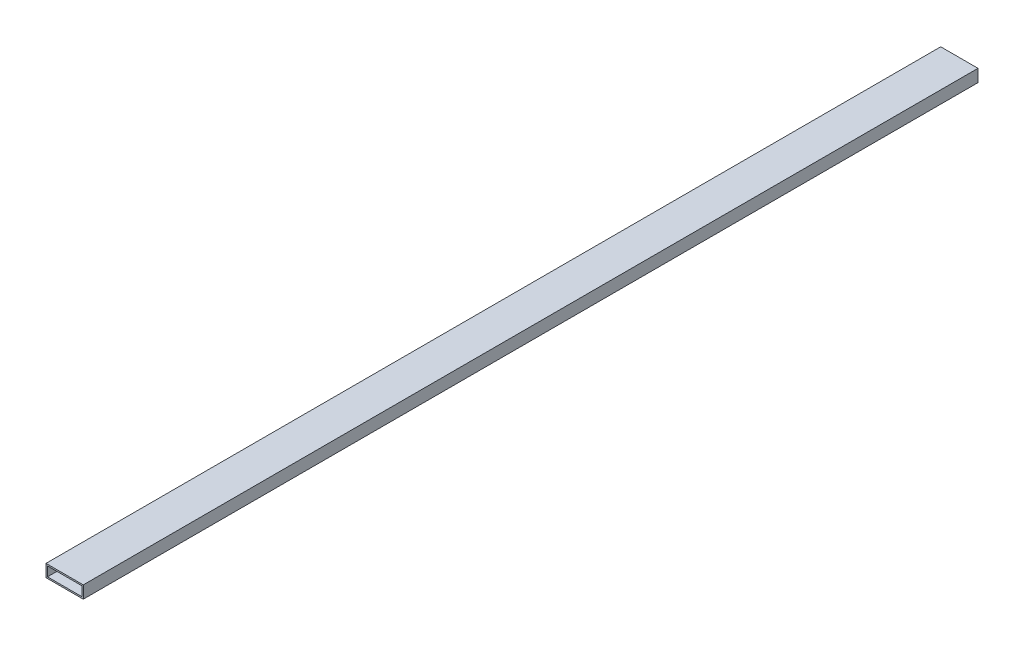
ISO-10303-21;
HEADER;
FILE_DESCRIPTION(('STEP AP214'),'2;1');
FILE_NAME('part.step','',(''),(''),'','','');
FILE_SCHEMA(('AUTOMOTIVE_DESIGN { 1 0 10303 214 1 1 1 1 }'));
ENDSEC;
DATA;
#1=APPLICATION_CONTEXT('core data for automotive mechanical design processes');
#2=APPLICATION_PROTOCOL_DEFINITION('international standard','automotive_design',2000,#1);
#3=PRODUCT_CONTEXT('',#1,'mechanical');
#4=PRODUCT('Part','Part','',(#3));
#5=PRODUCT_RELATED_PRODUCT_CATEGORY('part','',(#4));
#6=PRODUCT_DEFINITION_FORMATION('','',#4);
#7=PRODUCT_DEFINITION_CONTEXT('part definition',#1,'design');
#8=PRODUCT_DEFINITION('design','',#6,#7);
#9=PRODUCT_DEFINITION_SHAPE('','',#8);
#10=(LENGTH_UNIT() NAMED_UNIT(*) SI_UNIT(.MILLI.,.METRE.));
#11=(NAMED_UNIT(*) PLANE_ANGLE_UNIT() SI_UNIT($,.RADIAN.));
#12=(NAMED_UNIT(*) SI_UNIT($,.STERADIAN.) SOLID_ANGLE_UNIT());
#13=UNCERTAINTY_MEASURE_WITH_UNIT(LENGTH_MEASURE(1.E-05),#10,'distance_accuracy_value','');
#14=(GEOMETRIC_REPRESENTATION_CONTEXT(3) GLOBAL_UNCERTAINTY_ASSIGNED_CONTEXT((#13)) GLOBAL_UNIT_ASSIGNED_CONTEXT((#10,
#11,#12)) REPRESENTATION_CONTEXT('',''));
#15=CARTESIAN_POINT('',(0.,0.,0.));
#16=DIRECTION('',(0.,0.,1.));
#17=DIRECTION('',(1.,0.,0.));
#18=AXIS2_PLACEMENT_3D('',#15,#16,#17);
#19=CARTESIAN_POINT('',(-38.1,-12.7,-914.4));
#20=DIRECTION('',(0.,-1.,0.));
#21=DIRECTION('',(0.,0.,-1.));
#22=AXIS2_PLACEMENT_3D('',#19,#20,#21);
#23=PLANE('',#22);
#24=DIRECTION('',(0.,0.,1.));
#25=VECTOR('',#24,1.);
#26=CARTESIAN_POINT('',(-38.1,-12.7,-914.4));
#27=LINE('',#26,#25);
#28=CARTESIAN_POINT('',(-38.1,-12.7,-914.4));
#29=VERTEX_POINT('',#28);
#30=CARTESIAN_POINT('',(-38.1,-12.7,914.4));
#31=VERTEX_POINT('',#30);
#32=EDGE_CURVE('E114',#29,#31,#27,.T.);
#33=ORIENTED_EDGE('',*,*,#32,.F.);
#34=DIRECTION('',(1.,0.,0.));
#35=VECTOR('',#34,1.);
#36=CARTESIAN_POINT('',(0.,-12.7,-914.4));
#37=LINE('',#36,#35);
#38=CARTESIAN_POINT('',(38.1,-12.7,-914.4));
#39=VERTEX_POINT('',#38);
#40=EDGE_CURVE('E136',#29,#39,#37,.T.);
#41=ORIENTED_EDGE('',*,*,#40,.T.);
#42=DIRECTION('',(0.,0.,-1.));
#43=VECTOR('',#42,1.);
#44=CARTESIAN_POINT('',(38.1,-12.7,-914.4));
#45=LINE('',#44,#43);
#46=CARTESIAN_POINT('',(38.1,-12.7,914.4));
#47=VERTEX_POINT('',#46);
#48=EDGE_CURVE('E131',#47,#39,#45,.T.);
#49=ORIENTED_EDGE('',*,*,#48,.F.);
#50=DIRECTION('',(1.,0.,0.));
#51=VECTOR('',#50,1.);
#52=CARTESIAN_POINT('',(0.,-12.7,914.4));
#53=LINE('',#52,#51);
#54=EDGE_CURVE('E109',#31,#47,#53,.T.);
#55=ORIENTED_EDGE('',*,*,#54,.F.);
#56=EDGE_LOOP('',(#33,#41,#49,#55));
#57=FACE_BOUND('',#56,.T.);
#58=ADVANCED_FACE('F17',(#57),#23,.T.);
#59=CARTESIAN_POINT('',(-35.052,9.652,-914.4));
#60=DIRECTION('',(0.,-1.,0.));
#61=DIRECTION('',(0.,0.,-1.));
#62=AXIS2_PLACEMENT_3D('',#59,#60,#61);
#63=PLANE('',#62);
#64=DIRECTION('',(0.,0.,-1.));
#65=VECTOR('',#64,1.);
#66=CARTESIAN_POINT('',(-35.052,9.652,-914.4));
#67=LINE('',#66,#65);
#68=CARTESIAN_POINT('',(-35.052,9.652,-914.4));
#69=VERTEX_POINT('',#68);
#70=CARTESIAN_POINT('',(-35.052,9.652,914.4));
#71=VERTEX_POINT('',#70);
#72=EDGE_CURVE('E91',#69,#71,#67,.F.);
#73=ORIENTED_EDGE('',*,*,#72,.F.);
#74=DIRECTION('',(1.,0.,0.));
#75=VECTOR('',#74,1.);
#76=CARTESIAN_POINT('',(0.,9.652,-914.4));
#77=LINE('',#76,#75);
#78=CARTESIAN_POINT('',(35.052,9.652,-914.4));
#79=VERTEX_POINT('',#78);
#80=EDGE_CURVE('E139',#69,#79,#77,.T.);
#81=ORIENTED_EDGE('',*,*,#80,.T.);
#82=DIRECTION('',(0.,0.,1.));
#83=VECTOR('',#82,1.);
#84=CARTESIAN_POINT('',(35.052,9.652,-914.4));
#85=LINE('',#84,#83);
#86=CARTESIAN_POINT('',(35.052,9.652,914.4));
#87=VERTEX_POINT('',#86);
#88=EDGE_CURVE('E20',#87,#79,#85,.F.);
#89=ORIENTED_EDGE('',*,*,#88,.F.);
#90=DIRECTION('',(1.,0.,0.));
#91=VECTOR('',#90,1.);
#92=CARTESIAN_POINT('',(0.,9.652,914.4));
#93=LINE('',#92,#91);
#94=EDGE_CURVE('E105',#71,#87,#93,.T.);
#95=ORIENTED_EDGE('',*,*,#94,.F.);
#96=EDGE_LOOP('',(#73,#81,#89,#95));
#97=FACE_BOUND('',#96,.T.);
#98=ADVANCED_FACE('F125',(#97),#63,.T.);
#99=CARTESIAN_POINT('',(35.052,9.652,-914.4));
#100=DIRECTION('',(-1.,0.,0.));
#101=DIRECTION('',(0.,0.,1.));
#102=AXIS2_PLACEMENT_3D('',#99,#100,#101);
#103=PLANE('',#102);
#104=ORIENTED_EDGE('',*,*,#88,.T.);
#105=DIRECTION('',(0.,1.,0.));
#106=VECTOR('',#105,1.);
#107=CARTESIAN_POINT('',(35.052,0.,-914.4));
#108=LINE('',#107,#106);
#109=CARTESIAN_POINT('',(35.052,-9.652,-914.4));
#110=VERTEX_POINT('',#109);
#111=EDGE_CURVE('E88',#79,#110,#108,.F.);
#112=ORIENTED_EDGE('',*,*,#111,.T.);
#113=DIRECTION('',(0.,0.,1.));
#114=VECTOR('',#113,1.);
#115=CARTESIAN_POINT('',(35.052,-9.652,-914.4));
#116=LINE('',#115,#114);
#117=CARTESIAN_POINT('',(35.052,-9.652,914.4));
#118=VERTEX_POINT('',#117);
#119=EDGE_CURVE('E80',#118,#110,#116,.F.);
#120=ORIENTED_EDGE('',*,*,#119,.F.);
#121=DIRECTION('',(0.,1.,0.));
#122=VECTOR('',#121,1.);
#123=CARTESIAN_POINT('',(35.052,0.,914.4));
#124=LINE('',#123,#122);
#125=EDGE_CURVE('E85',#87,#118,#124,.F.);
#126=ORIENTED_EDGE('',*,*,#125,.F.);
#127=EDGE_LOOP('',(#104,#112,#120,#126));
#128=FACE_BOUND('',#127,.T.);
#129=ADVANCED_FACE('F83',(#128),#103,.T.);
#130=CARTESIAN_POINT('',(35.052,-9.652,-914.4));
#131=DIRECTION('',(0.,1.,0.));
#132=DIRECTION('',(0.,0.,1.));
#133=AXIS2_PLACEMENT_3D('',#130,#131,#132);
#134=PLANE('',#133);
#135=ORIENTED_EDGE('',*,*,#119,.T.);
#136=DIRECTION('',(1.,0.,0.));
#137=VECTOR('',#136,1.);
#138=CARTESIAN_POINT('',(0.,-9.652,-914.4));
#139=LINE('',#138,#137);
#140=CARTESIAN_POINT('',(-35.052,-9.652,-914.4));
#141=VERTEX_POINT('',#140);
#142=EDGE_CURVE('E142',#110,#141,#139,.F.);
#143=ORIENTED_EDGE('',*,*,#142,.T.);
#144=DIRECTION('',(0.,0.,-1.));
#145=VECTOR('',#144,1.);
#146=CARTESIAN_POINT('',(-35.052,-9.652,-914.4));
#147=LINE('',#146,#145);
#148=CARTESIAN_POINT('',(-35.052,-9.652,914.4));
#149=VERTEX_POINT('',#148);
#150=EDGE_CURVE('E96',#149,#141,#147,.T.);
#151=ORIENTED_EDGE('',*,*,#150,.F.);
#152=DIRECTION('',(1.,0.,0.));
#153=VECTOR('',#152,1.);
#154=CARTESIAN_POINT('',(0.,-9.652,914.4));
#155=LINE('',#154,#153);
#156=EDGE_CURVE('E93',#118,#149,#155,.F.);
#157=ORIENTED_EDGE('',*,*,#156,.F.);
#158=EDGE_LOOP('',(#135,#143,#151,#157));
#159=FACE_BOUND('',#158,.T.);
#160=ADVANCED_FACE('F94',(#159),#134,.T.);
#161=CARTESIAN_POINT('',(-35.052,-9.652,-914.4));
#162=DIRECTION('',(1.,0.,0.));
#163=DIRECTION('',(0.,0.,-1.));
#164=AXIS2_PLACEMENT_3D('',#161,#162,#163);
#165=PLANE('',#164);
#166=ORIENTED_EDGE('',*,*,#150,.T.);
#167=DIRECTION('',(0.,1.,0.));
#168=VECTOR('',#167,1.);
#169=CARTESIAN_POINT('',(-35.052,0.,-914.4));
#170=LINE('',#169,#168);
#171=EDGE_CURVE('E122',#141,#69,#170,.T.);
#172=ORIENTED_EDGE('',*,*,#171,.T.);
#173=ORIENTED_EDGE('',*,*,#72,.T.);
#174=DIRECTION('',(0.,1.,0.));
#175=VECTOR('',#174,1.);
#176=CARTESIAN_POINT('',(-35.052,0.,914.4));
#177=LINE('',#176,#175);
#178=EDGE_CURVE('E100',#149,#71,#177,.T.);
#179=ORIENTED_EDGE('',*,*,#178,.F.);
#180=EDGE_LOOP('',(#166,#172,#173,#179));
#181=FACE_BOUND('',#180,.T.);
#182=ADVANCED_FACE('F120',(#181),#165,.T.);
#183=CARTESIAN_POINT('',(-38.1,12.7,-914.4));
#184=DIRECTION('',(-1.,0.,0.));
#185=DIRECTION('',(0.,0.,1.));
#186=AXIS2_PLACEMENT_3D('',#183,#184,#185);
#187=PLANE('',#186);
#188=DIRECTION('',(0.,0.,1.));
#189=VECTOR('',#188,1.);
#190=CARTESIAN_POINT('',(-38.1,12.7,-914.4));
#191=LINE('',#190,#189);
#192=CARTESIAN_POINT('',(-38.1,12.7,-914.4));
#193=VERTEX_POINT('',#192);
#194=CARTESIAN_POINT('',(-38.1,12.7,914.4));
#195=VERTEX_POINT('',#194);
#196=EDGE_CURVE('E145',#193,#195,#191,.T.);
#197=ORIENTED_EDGE('',*,*,#196,.F.);
#198=DIRECTION('',(0.,1.,0.));
#199=VECTOR('',#198,1.);
#200=CARTESIAN_POINT('',(-38.1,0.,-914.4));
#201=LINE('',#200,#199);
#202=EDGE_CURVE('E133',#193,#29,#201,.F.);
#203=ORIENTED_EDGE('',*,*,#202,.T.);
#204=ORIENTED_EDGE('',*,*,#32,.T.);
#205=DIRECTION('',(0.,1.,0.));
#206=VECTOR('',#205,1.);
#207=CARTESIAN_POINT('',(-38.1,0.,914.4));
#208=LINE('',#207,#206);
#209=EDGE_CURVE('E106',#195,#31,#208,.F.);
#210=ORIENTED_EDGE('',*,*,#209,.F.);
#211=EDGE_LOOP('',(#197,#203,#204,#210));
#212=FACE_BOUND('',#211,.T.);
#213=ADVANCED_FACE('F164',(#212),#187,.T.);
#214=CARTESIAN_POINT('',(0.,0.,914.4));
#215=DIRECTION('',(0.,0.,1.));
#216=DIRECTION('',(1.,0.,0.));
#217=AXIS2_PLACEMENT_3D('',#214,#215,#216);
#218=PLANE('',#217);
#219=ORIENTED_EDGE('',*,*,#178,.T.);
#220=ORIENTED_EDGE('',*,*,#94,.T.);
#221=ORIENTED_EDGE('',*,*,#125,.T.);
#222=ORIENTED_EDGE('',*,*,#156,.T.);
#223=EDGE_LOOP('',(#219,#220,#221,#222));
#224=FACE_BOUND('',#223,.T.);
#225=DIRECTION('',(1.,0.,0.));
#226=VECTOR('',#225,1.);
#227=CARTESIAN_POINT('',(38.1,12.7,914.4));
#228=LINE('',#227,#226);
#229=CARTESIAN_POINT('',(38.1,12.7,914.4));
#230=VERTEX_POINT('',#229);
#231=EDGE_CURVE('E148',#195,#230,#228,.T.);
#232=ORIENTED_EDGE('',*,*,#231,.F.);
#233=ORIENTED_EDGE('',*,*,#209,.T.);
#234=ORIENTED_EDGE('',*,*,#54,.T.);
#235=DIRECTION('',(0.,1.,0.));
#236=VECTOR('',#235,1.);
#237=CARTESIAN_POINT('',(38.1,-12.7,914.4));
#238=LINE('',#237,#236);
#239=EDGE_CURVE('E126',#230,#47,#238,.F.);
#240=ORIENTED_EDGE('',*,*,#239,.F.);
#241=EDGE_LOOP('',(#232,#233,#234,#240));
#242=FACE_BOUND('',#241,.T.);
#243=ADVANCED_FACE('F102',(#224,#242),#218,.T.);
#244=CARTESIAN_POINT('',(38.1,-12.7,-914.4));
#245=DIRECTION('',(1.,0.,0.));
#246=DIRECTION('',(0.,0.,-1.));
#247=AXIS2_PLACEMENT_3D('',#244,#245,#246);
#248=PLANE('',#247);
#249=ORIENTED_EDGE('',*,*,#48,.T.);
#250=DIRECTION('',(0.,1.,0.));
#251=VECTOR('',#250,1.);
#252=CARTESIAN_POINT('',(38.1,0.,-914.4));
#253=LINE('',#252,#251);
#254=CARTESIAN_POINT('',(38.1,12.7,-914.4));
#255=VERTEX_POINT('',#254);
#256=EDGE_CURVE('E35',#39,#255,#253,.T.);
#257=ORIENTED_EDGE('',*,*,#256,.T.);
#258=DIRECTION('',(0.,0.,1.));
#259=VECTOR('',#258,1.);
#260=CARTESIAN_POINT('',(38.1,12.7,-914.4));
#261=LINE('',#260,#259);
#262=EDGE_CURVE('E26',#230,#255,#261,.F.);
#263=ORIENTED_EDGE('',*,*,#262,.F.);
#264=ORIENTED_EDGE('',*,*,#239,.T.);
#265=EDGE_LOOP('',(#249,#257,#263,#264));
#266=FACE_BOUND('',#265,.T.);
#267=ADVANCED_FACE('F155',(#266),#248,.T.);
#268=CARTESIAN_POINT('',(0.,0.,-914.4));
#269=DIRECTION('',(0.,0.,1.));
#270=DIRECTION('',(1.,0.,0.));
#271=AXIS2_PLACEMENT_3D('',#268,#269,#270);
#272=PLANE('',#271);
#273=ORIENTED_EDGE('',*,*,#142,.F.);
#274=ORIENTED_EDGE('',*,*,#111,.F.);
#275=ORIENTED_EDGE('',*,*,#80,.F.);
#276=ORIENTED_EDGE('',*,*,#171,.F.);
#277=EDGE_LOOP('',(#273,#274,#275,#276));
#278=FACE_BOUND('',#277,.T.);
#279=ORIENTED_EDGE('',*,*,#256,.F.);
#280=ORIENTED_EDGE('',*,*,#40,.F.);
#281=ORIENTED_EDGE('',*,*,#202,.F.);
#282=DIRECTION('',(1.,0.,0.));
#283=VECTOR('',#282,1.);
#284=CARTESIAN_POINT('',(38.1,12.7,-914.4));
#285=LINE('',#284,#283);
#286=EDGE_CURVE('E11',#255,#193,#285,.F.);
#287=ORIENTED_EDGE('',*,*,#286,.F.);
#288=EDGE_LOOP('',(#279,#280,#281,#287));
#289=FACE_BOUND('',#288,.T.);
#290=ADVANCED_FACE('F162',(#278,#289),#272,.F.);
#291=CARTESIAN_POINT('',(38.1,12.7,-914.4));
#292=DIRECTION('',(0.,1.,0.));
#293=DIRECTION('',(0.,0.,1.));
#294=AXIS2_PLACEMENT_3D('',#291,#292,#293);
#295=PLANE('',#294);
#296=ORIENTED_EDGE('',*,*,#262,.T.);
#297=ORIENTED_EDGE('',*,*,#286,.T.);
#298=ORIENTED_EDGE('',*,*,#196,.T.);
#299=ORIENTED_EDGE('',*,*,#231,.T.);
#300=EDGE_LOOP('',(#296,#297,#298,#299));
#301=FACE_BOUND('',#300,.T.);
#302=ADVANCED_FACE('F153',(#301),#295,.T.);
#303=CLOSED_SHELL('',(#58,#98,#129,#160,#182,#213,#243,#267,#290,#302));
#304=MANIFOLD_SOLID_BREP('B1',#303);
#305=ADVANCED_BREP_SHAPE_REPRESENTATION('',(#18,#304),#14);
#306=SHAPE_DEFINITION_REPRESENTATION(#9,#305);
ENDSEC;
END-ISO-10303-21;
